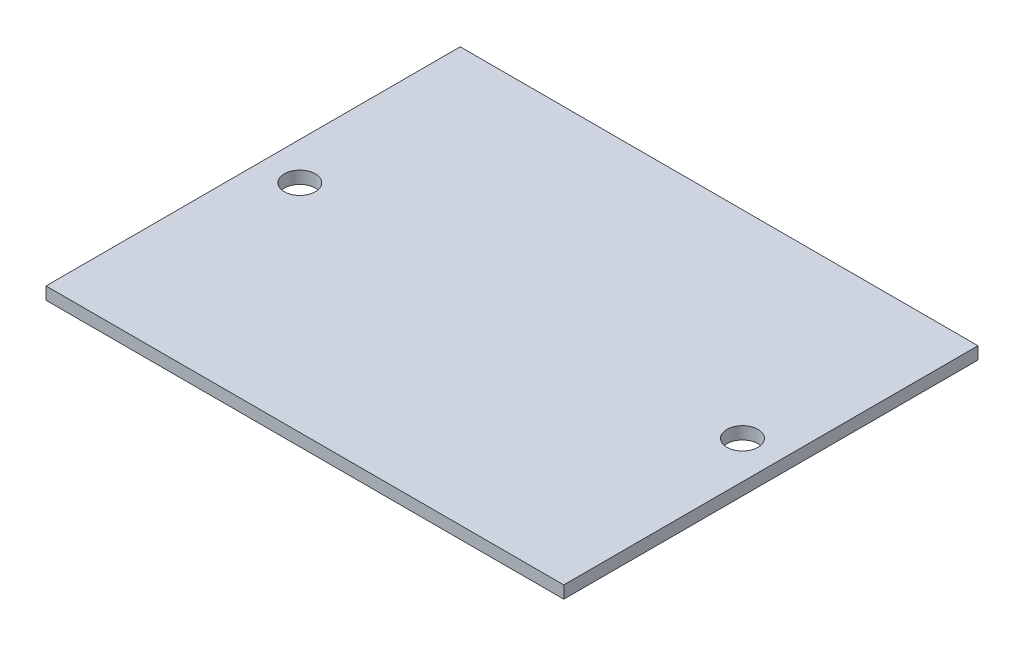
ISO-10303-21;
HEADER;
FILE_DESCRIPTION(('STEP AP214'),'2;1');
FILE_NAME('part.step','',(''),(''),'','','');
FILE_SCHEMA(('AUTOMOTIVE_DESIGN { 1 0 10303 214 1 1 1 1 }'));
ENDSEC;
DATA;
#1=APPLICATION_CONTEXT('core data for automotive mechanical design processes');
#2=APPLICATION_PROTOCOL_DEFINITION('international standard','automotive_design',2000,#1);
#3=PRODUCT_CONTEXT('',#1,'mechanical');
#4=PRODUCT('Part','Part','',(#3));
#5=PRODUCT_RELATED_PRODUCT_CATEGORY('part','',(#4));
#6=PRODUCT_DEFINITION_FORMATION('','',#4);
#7=PRODUCT_DEFINITION_CONTEXT('part definition',#1,'design');
#8=PRODUCT_DEFINITION('design','',#6,#7);
#9=PRODUCT_DEFINITION_SHAPE('','',#8);
#10=(LENGTH_UNIT() NAMED_UNIT(*) SI_UNIT(.MILLI.,.METRE.));
#11=(NAMED_UNIT(*) PLANE_ANGLE_UNIT() SI_UNIT($,.RADIAN.));
#12=(NAMED_UNIT(*) SI_UNIT($,.STERADIAN.) SOLID_ANGLE_UNIT());
#13=UNCERTAINTY_MEASURE_WITH_UNIT(LENGTH_MEASURE(1.E-05),#10,'distance_accuracy_value','');
#14=(GEOMETRIC_REPRESENTATION_CONTEXT(3) GLOBAL_UNCERTAINTY_ASSIGNED_CONTEXT((#13)) GLOBAL_UNIT_ASSIGNED_CONTEXT((#10,
#11,#12)) REPRESENTATION_CONTEXT('',''));
#15=CARTESIAN_POINT('',(0.,0.,0.));
#16=DIRECTION('',(0.,0.,1.));
#17=DIRECTION('',(1.,0.,0.));
#18=AXIS2_PLACEMENT_3D('',#15,#16,#17);
#19=CARTESIAN_POINT('',(0.,5.9944,0.));
#20=DIRECTION('',(0.,-1.,0.));
#21=DIRECTION('',(0.,0.,-1.));
#22=AXIS2_PLACEMENT_3D('',#19,#20,#21);
#23=PLANE('',#22);
#24=DIRECTION('',(0.,0.,1.));
#25=VECTOR('',#24,1.);
#26=CARTESIAN_POINT('',(0.,5.9944,0.));
#27=LINE('',#26,#25);
#28=CARTESIAN_POINT('',(0.,5.9944,-200.));
#29=VERTEX_POINT('',#28);
#30=CARTESIAN_POINT('',(0.,5.9944,0.));
#31=VERTEX_POINT('',#30);
#32=EDGE_CURVE('E85',#29,#31,#27,.T.);
#33=ORIENTED_EDGE('',*,*,#32,.T.);
#34=DIRECTION('',(1.,0.,0.));
#35=VECTOR('',#34,1.);
#36=CARTESIAN_POINT('',(0.,5.9944,0.));
#37=LINE('',#36,#35);
#38=CARTESIAN_POINT('',(250.,5.9944,0.));
#39=VERTEX_POINT('',#38);
#40=EDGE_CURVE('E80',#31,#39,#37,.T.);
#41=ORIENTED_EDGE('',*,*,#40,.T.);
#42=DIRECTION('',(0.,0.,-1.));
#43=VECTOR('',#42,1.);
#44=CARTESIAN_POINT('',(250.,5.9944,0.));
#45=LINE('',#44,#43);
#46=CARTESIAN_POINT('',(250.,5.9944,-200.));
#47=VERTEX_POINT('',#46);
#48=EDGE_CURVE('E83',#39,#47,#45,.T.);
#49=ORIENTED_EDGE('',*,*,#48,.T.);
#50=DIRECTION('',(-1.,0.,0.));
#51=VECTOR('',#50,1.);
#52=CARTESIAN_POINT('',(0.,5.9944,-200.));
#53=LINE('',#52,#51);
#54=EDGE_CURVE('E50',#47,#29,#53,.T.);
#55=ORIENTED_EDGE('',*,*,#54,.T.);
#56=EDGE_LOOP('',(#33,#41,#49,#55));
#57=FACE_BOUND('',#56,.T.);
#58=CARTESIAN_POINT('',(18.125,5.9944,-104.409742407347));
#59=DIRECTION('',(0.,1.,0.));
#60=DIRECTION('',(0.,0.,1.));
#61=AXIS2_PLACEMENT_3D('',#58,#59,#60);
#62=CIRCLE('',#61,7.5);
#63=CARTESIAN_POINT('',(18.125,5.9944,-96.909742407347));
#64=VERTEX_POINT('',#63);
#65=EDGE_CURVE('E100',#64,#64,#62,.T.);
#66=ORIENTED_EDGE('',*,*,#65,.F.);
#67=EDGE_LOOP('',(#66));
#68=FACE_BOUND('',#67,.T.);
#69=CARTESIAN_POINT('',(231.875,5.9944,-104.409742407347));
#70=DIRECTION('',(0.,1.,0.));
#71=DIRECTION('',(0.,0.,1.));
#72=AXIS2_PLACEMENT_3D('',#69,#70,#71);
#73=CIRCLE('',#72,7.50000000000001);
#74=CARTESIAN_POINT('',(231.875,5.9944,-96.909742407347));
#75=VERTEX_POINT('',#74);
#76=EDGE_CURVE('E115',#75,#75,#73,.T.);
#77=ORIENTED_EDGE('',*,*,#76,.F.);
#78=EDGE_LOOP('',(#77));
#79=FACE_BOUND('',#78,.T.);
#80=ADVANCED_FACE('F33',(#57,#68,#79),#23,.F.);
#81=CARTESIAN_POINT('',(0.,0.,0.));
#82=DIRECTION('',(0.,-1.,0.));
#83=DIRECTION('',(0.,0.,-1.));
#84=AXIS2_PLACEMENT_3D('',#81,#82,#83);
#85=PLANE('',#84);
#86=CARTESIAN_POINT('',(18.125,0.,-104.409742407347));
#87=DIRECTION('',(0.,1.,0.));
#88=DIRECTION('',(0.,0.,1.));
#89=AXIS2_PLACEMENT_3D('',#86,#87,#88);
#90=CIRCLE('',#89,7.5);
#91=CARTESIAN_POINT('',(18.125,0.,-96.909742407347));
#92=VERTEX_POINT('',#91);
#93=EDGE_CURVE('E112',#92,#92,#90,.T.);
#94=ORIENTED_EDGE('',*,*,#93,.T.);
#95=EDGE_LOOP('',(#94));
#96=FACE_BOUND('',#95,.T.);
#97=DIRECTION('',(0.,0.,1.));
#98=VECTOR('',#97,1.);
#99=CARTESIAN_POINT('',(0.,0.,0.));
#100=LINE('',#99,#98);
#101=CARTESIAN_POINT('',(0.,0.,-200.));
#102=VERTEX_POINT('',#101);
#103=CARTESIAN_POINT('',(0.,0.,0.));
#104=VERTEX_POINT('',#103);
#105=EDGE_CURVE('E97',#102,#104,#100,.T.);
#106=ORIENTED_EDGE('',*,*,#105,.F.);
#107=DIRECTION('',(-1.,0.,0.));
#108=VECTOR('',#107,1.);
#109=CARTESIAN_POINT('',(0.,0.,-200.));
#110=LINE('',#109,#108);
#111=CARTESIAN_POINT('',(250.,0.,-200.));
#112=VERTEX_POINT('',#111);
#113=EDGE_CURVE('E73',#112,#102,#110,.T.);
#114=ORIENTED_EDGE('',*,*,#113,.F.);
#115=DIRECTION('',(0.,0.,-1.));
#116=VECTOR('',#115,1.);
#117=CARTESIAN_POINT('',(250.,0.,0.));
#118=LINE('',#117,#116);
#119=CARTESIAN_POINT('',(250.,0.,0.));
#120=VERTEX_POINT('',#119);
#121=EDGE_CURVE('E67',#120,#112,#118,.T.);
#122=ORIENTED_EDGE('',*,*,#121,.F.);
#123=DIRECTION('',(1.,0.,0.));
#124=VECTOR('',#123,1.);
#125=CARTESIAN_POINT('',(0.,0.,0.));
#126=LINE('',#125,#124);
#127=EDGE_CURVE('E89',#104,#120,#126,.T.);
#128=ORIENTED_EDGE('',*,*,#127,.F.);
#129=EDGE_LOOP('',(#106,#114,#122,#128));
#130=FACE_BOUND('',#129,.T.);
#131=CARTESIAN_POINT('',(231.875,0.,-104.409742407347));
#132=DIRECTION('',(0.,1.,0.));
#133=DIRECTION('',(0.,0.,1.));
#134=AXIS2_PLACEMENT_3D('',#131,#132,#133);
#135=CIRCLE('',#134,7.50000000000001);
#136=CARTESIAN_POINT('',(231.875,0.,-96.909742407347));
#137=VERTEX_POINT('',#136);
#138=EDGE_CURVE('E118',#137,#137,#135,.T.);
#139=ORIENTED_EDGE('',*,*,#138,.T.);
#140=EDGE_LOOP('',(#139));
#141=FACE_BOUND('',#140,.T.);
#142=ADVANCED_FACE('F108',(#96,#130,#141),#85,.T.);
#143=CARTESIAN_POINT('',(0.,5.9944,0.));
#144=DIRECTION('',(1.,0.,0.));
#145=DIRECTION('',(0.,0.,-1.));
#146=AXIS2_PLACEMENT_3D('',#143,#144,#145);
#147=PLANE('',#146);
#148=ORIENTED_EDGE('',*,*,#105,.T.);
#149=DIRECTION('',(0.,-1.,0.));
#150=VECTOR('',#149,1.);
#151=CARTESIAN_POINT('',(0.,5.9944,0.));
#152=LINE('',#151,#150);
#153=EDGE_CURVE('E11',#31,#104,#152,.T.);
#154=ORIENTED_EDGE('',*,*,#153,.F.);
#155=ORIENTED_EDGE('',*,*,#32,.F.);
#156=DIRECTION('',(0.,-1.,0.));
#157=VECTOR('',#156,1.);
#158=CARTESIAN_POINT('',(0.,5.9944,-200.));
#159=LINE('',#158,#157);
#160=EDGE_CURVE('E93',#29,#102,#159,.T.);
#161=ORIENTED_EDGE('',*,*,#160,.T.);
#162=EDGE_LOOP('',(#148,#154,#155,#161));
#163=FACE_BOUND('',#162,.T.);
#164=ADVANCED_FACE('F35',(#163),#147,.F.);
#165=CARTESIAN_POINT('',(0.,5.9944,0.));
#166=DIRECTION('',(0.,0.,-1.));
#167=DIRECTION('',(-1.,0.,0.));
#168=AXIS2_PLACEMENT_3D('',#165,#166,#167);
#169=PLANE('',#168);
#170=ORIENTED_EDGE('',*,*,#127,.T.);
#171=DIRECTION('',(0.,-1.,0.));
#172=VECTOR('',#171,1.);
#173=CARTESIAN_POINT('',(250.,5.9944,0.));
#174=LINE('',#173,#172);
#175=EDGE_CURVE('E42',#39,#120,#174,.T.);
#176=ORIENTED_EDGE('',*,*,#175,.F.);
#177=ORIENTED_EDGE('',*,*,#40,.F.);
#178=ORIENTED_EDGE('',*,*,#153,.T.);
#179=EDGE_LOOP('',(#170,#176,#177,#178));
#180=FACE_BOUND('',#179,.T.);
#181=ADVANCED_FACE('F88',(#180),#169,.F.);
#182=CARTESIAN_POINT('',(250.,5.9944,0.));
#183=DIRECTION('',(-1.,0.,0.));
#184=DIRECTION('',(0.,0.,1.));
#185=AXIS2_PLACEMENT_3D('',#182,#183,#184);
#186=PLANE('',#185);
#187=ORIENTED_EDGE('',*,*,#121,.T.);
#188=DIRECTION('',(0.,-1.,0.));
#189=VECTOR('',#188,1.);
#190=CARTESIAN_POINT('',(250.,5.9944,-200.));
#191=LINE('',#190,#189);
#192=EDGE_CURVE('E90',#47,#112,#191,.T.);
#193=ORIENTED_EDGE('',*,*,#192,.F.);
#194=ORIENTED_EDGE('',*,*,#48,.F.);
#195=ORIENTED_EDGE('',*,*,#175,.T.);
#196=EDGE_LOOP('',(#187,#193,#194,#195));
#197=FACE_BOUND('',#196,.T.);
#198=ADVANCED_FACE('F91',(#197),#186,.F.);
#199=CARTESIAN_POINT('',(0.,5.9944,-200.));
#200=DIRECTION('',(0.,0.,1.));
#201=DIRECTION('',(1.,0.,0.));
#202=AXIS2_PLACEMENT_3D('',#199,#200,#201);
#203=PLANE('',#202);
#204=ORIENTED_EDGE('',*,*,#113,.T.);
#205=ORIENTED_EDGE('',*,*,#160,.F.);
#206=ORIENTED_EDGE('',*,*,#54,.F.);
#207=ORIENTED_EDGE('',*,*,#192,.T.);
#208=EDGE_LOOP('',(#204,#205,#206,#207));
#209=FACE_BOUND('',#208,.T.);
#210=ADVANCED_FACE('F105',(#209),#203,.F.);
#211=CARTESIAN_POINT('',(18.125,5.9944,-104.409742407347));
#212=DIRECTION('',(0.,-1.,0.));
#213=DIRECTION('',(0.,0.,-1.));
#214=AXIS2_PLACEMENT_3D('',#211,#212,#213);
#215=CYLINDRICAL_SURFACE('',#214,7.5);
#216=ORIENTED_EDGE('',*,*,#65,.T.);
#217=EDGE_LOOP('',(#216));
#218=FACE_BOUND('',#217,.T.);
#219=ORIENTED_EDGE('',*,*,#93,.F.);
#220=EDGE_LOOP('',(#219));
#221=FACE_BOUND('',#220,.T.);
#222=ADVANCED_FACE('F135',(#218,#221),#215,.F.);
#223=CARTESIAN_POINT('',(231.875,5.9944,-104.409742407347));
#224=DIRECTION('',(0.,-1.,0.));
#225=DIRECTION('',(0.,0.,-1.));
#226=AXIS2_PLACEMENT_3D('',#223,#224,#225);
#227=CYLINDRICAL_SURFACE('',#226,7.50000000000001);
#228=ORIENTED_EDGE('',*,*,#76,.T.);
#229=EDGE_LOOP('',(#228));
#230=FACE_BOUND('',#229,.T.);
#231=ORIENTED_EDGE('',*,*,#138,.F.);
#232=EDGE_LOOP('',(#231));
#233=FACE_BOUND('',#232,.T.);
#234=ADVANCED_FACE('F124',(#230,#233),#227,.F.);
#235=CLOSED_SHELL('',(#80,#142,#164,#181,#198,#210,#222,#234));
#236=MANIFOLD_SOLID_BREP('B2',#235);
#237=ADVANCED_BREP_SHAPE_REPRESENTATION('',(#18,#236),#14);
#238=SHAPE_DEFINITION_REPRESENTATION(#9,#237);
ENDSEC;
END-ISO-10303-21;
